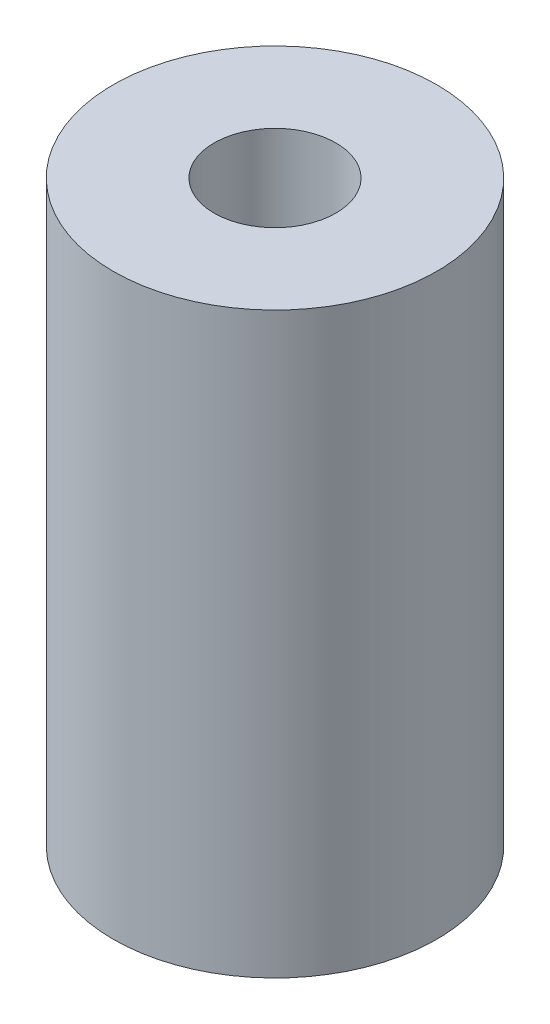
ISO-10303-21;
HEADER;
FILE_DESCRIPTION(('STEP AP214'),'2;1');
FILE_NAME('part.step','',(''),(''),'','','');
FILE_SCHEMA(('AUTOMOTIVE_DESIGN { 1 0 10303 214 1 1 1 1 }'));
ENDSEC;
DATA;
#1=APPLICATION_CONTEXT('core data for automotive mechanical design processes');
#2=APPLICATION_PROTOCOL_DEFINITION('international standard','automotive_design',2000,#1);
#3=PRODUCT_CONTEXT('',#1,'mechanical');
#4=PRODUCT('Part','Part','',(#3));
#5=PRODUCT_RELATED_PRODUCT_CATEGORY('part','',(#4));
#6=PRODUCT_DEFINITION_FORMATION('','',#4);
#7=PRODUCT_DEFINITION_CONTEXT('part definition',#1,'design');
#8=PRODUCT_DEFINITION('design','',#6,#7);
#9=PRODUCT_DEFINITION_SHAPE('','',#8);
#10=(LENGTH_UNIT() NAMED_UNIT(*) SI_UNIT(.MILLI.,.METRE.));
#11=(NAMED_UNIT(*) PLANE_ANGLE_UNIT() SI_UNIT($,.RADIAN.));
#12=(NAMED_UNIT(*) SI_UNIT($,.STERADIAN.) SOLID_ANGLE_UNIT());
#13=UNCERTAINTY_MEASURE_WITH_UNIT(LENGTH_MEASURE(1.E-05),#10,'distance_accuracy_value','');
#14=(GEOMETRIC_REPRESENTATION_CONTEXT(3) GLOBAL_UNCERTAINTY_ASSIGNED_CONTEXT((#13)) GLOBAL_UNIT_ASSIGNED_CONTEXT((#10,
#11,#12)) REPRESENTATION_CONTEXT('',''));
#15=CARTESIAN_POINT('',(0.,0.,0.));
#16=DIRECTION('',(0.,0.,1.));
#17=DIRECTION('',(1.,0.,0.));
#18=AXIS2_PLACEMENT_3D('',#15,#16,#17);
#19=CARTESIAN_POINT('',(0.,152.4,0.));
#20=DIRECTION('',(0.,1.,0.));
#21=DIRECTION('',(0.,0.,1.));
#22=AXIS2_PLACEMENT_3D('',#19,#20,#21);
#23=PLANE('',#22);
#24=CARTESIAN_POINT('',(0.,152.4,0.));
#25=DIRECTION('',(0.,1.,0.));
#26=DIRECTION('',(0.,0.,1.));
#27=AXIS2_PLACEMENT_3D('',#24,#25,#26);
#28=CIRCLE('',#27,42.6085);
#29=CARTESIAN_POINT('',(0.,152.4,42.6085000000002));
#30=VERTEX_POINT('',#29);
#31=EDGE_CURVE('E10',#30,#30,#28,.T.);
#32=ORIENTED_EDGE('',*,*,#31,.T.);
#33=EDGE_LOOP('',(#32));
#34=FACE_BOUND('',#33,.T.);
#35=CARTESIAN_POINT('',(0.,152.4,0.));
#36=DIRECTION('',(0.,1.,0.));
#37=DIRECTION('',(0.,0.,1.));
#38=AXIS2_PLACEMENT_3D('',#35,#36,#37);
#39=CIRCLE('',#38,16.0401);
#40=CARTESIAN_POINT('',(0.,152.4,16.0401000000001));
#41=VERTEX_POINT('',#40);
#42=EDGE_CURVE('E41',#41,#41,#39,.T.);
#43=ORIENTED_EDGE('',*,*,#42,.F.);
#44=EDGE_LOOP('',(#43));
#45=FACE_BOUND('',#44,.T.);
#46=ADVANCED_FACE('F30',(#34,#45),#23,.T.);
#47=CARTESIAN_POINT('',(0.,0.,0.));
#48=DIRECTION('',(0.,1.,0.));
#49=DIRECTION('',(0.,0.,1.));
#50=AXIS2_PLACEMENT_3D('',#47,#48,#49);
#51=PLANE('',#50);
#52=CARTESIAN_POINT('',(0.,0.,0.));
#53=DIRECTION('',(0.,1.,0.));
#54=DIRECTION('',(0.,0.,1.));
#55=AXIS2_PLACEMENT_3D('',#52,#53,#54);
#56=CIRCLE('',#55,42.6085);
#57=CARTESIAN_POINT('',(0.,0.,42.6085000000002));
#58=VERTEX_POINT('',#57);
#59=EDGE_CURVE('E34',#58,#58,#56,.T.);
#60=ORIENTED_EDGE('',*,*,#59,.F.);
#61=EDGE_LOOP('',(#60));
#62=FACE_BOUND('',#61,.T.);
#63=CARTESIAN_POINT('',(0.,0.,0.));
#64=DIRECTION('',(0.,1.,0.));
#65=DIRECTION('',(0.,0.,1.));
#66=AXIS2_PLACEMENT_3D('',#63,#64,#65);
#67=CIRCLE('',#66,16.0401);
#68=CARTESIAN_POINT('',(0.,0.,16.0401000000001));
#69=VERTEX_POINT('',#68);
#70=EDGE_CURVE('E43',#69,#69,#67,.T.);
#71=ORIENTED_EDGE('',*,*,#70,.T.);
#72=EDGE_LOOP('',(#71));
#73=FACE_BOUND('',#72,.T.);
#74=ADVANCED_FACE('F53',(#62,#73),#51,.F.);
#75=CARTESIAN_POINT('',(0.,152.4,0.));
#76=DIRECTION('',(0.,-1.,0.));
#77=DIRECTION('',(0.,0.,-1.));
#78=AXIS2_PLACEMENT_3D('',#75,#76,#77);
#79=CYLINDRICAL_SURFACE('',#78,42.6085);
#80=ORIENTED_EDGE('',*,*,#31,.F.);
#81=EDGE_LOOP('',(#80));
#82=FACE_BOUND('',#81,.T.);
#83=ORIENTED_EDGE('',*,*,#59,.T.);
#84=EDGE_LOOP('',(#83));
#85=FACE_BOUND('',#84,.T.);
#86=ADVANCED_FACE('F32',(#82,#85),#79,.T.);
#87=CARTESIAN_POINT('',(0.,152.4,0.));
#88=DIRECTION('',(0.,-1.,0.));
#89=DIRECTION('',(0.,0.,-1.));
#90=AXIS2_PLACEMENT_3D('',#87,#88,#89);
#91=CYLINDRICAL_SURFACE('',#90,16.0401);
#92=ORIENTED_EDGE('',*,*,#42,.T.);
#93=EDGE_LOOP('',(#92));
#94=FACE_BOUND('',#93,.T.);
#95=ORIENTED_EDGE('',*,*,#70,.F.);
#96=EDGE_LOOP('',(#95));
#97=FACE_BOUND('',#96,.T.);
#98=ADVANCED_FACE('F49',(#94,#97),#91,.F.);
#99=CLOSED_SHELL('',(#46,#74,#86,#98));
#100=MANIFOLD_SOLID_BREP('B2',#99);
#101=ADVANCED_BREP_SHAPE_REPRESENTATION('',(#18,#100),#14);
#102=SHAPE_DEFINITION_REPRESENTATION(#9,#101);
ENDSEC;
END-ISO-10303-21;
